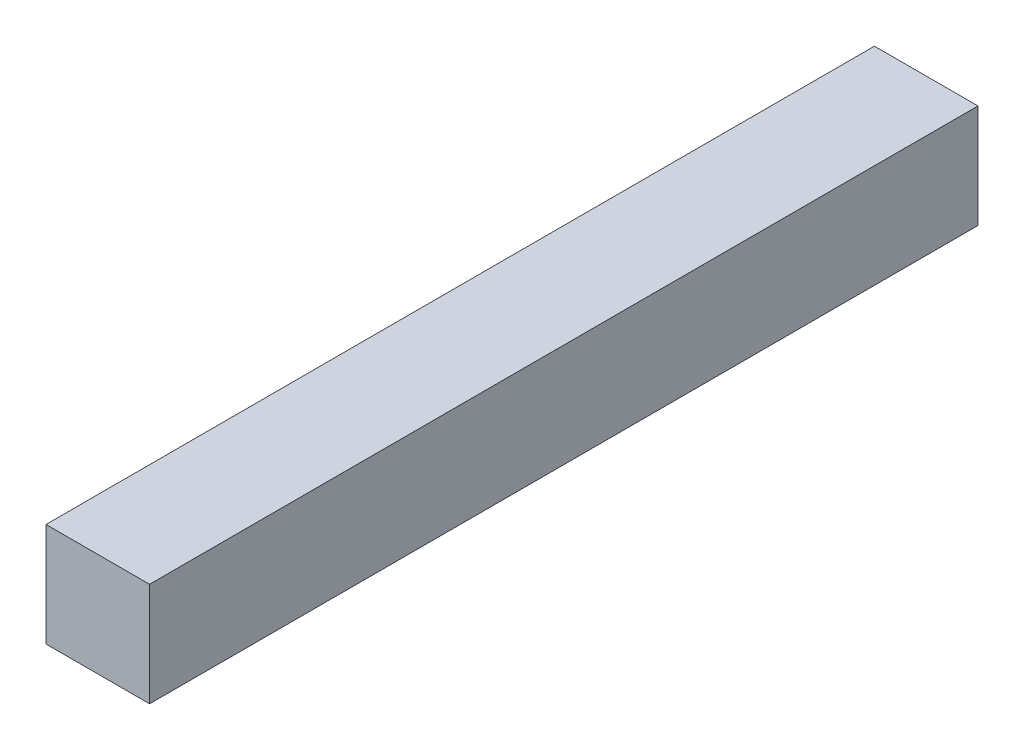
ISO-10303-21;
HEADER;
FILE_DESCRIPTION(('STEP AP214'),'2;1');
FILE_NAME('part.step','',(''),(''),'','','');
FILE_SCHEMA(('AUTOMOTIVE_DESIGN { 1 0 10303 214 1 1 1 1 }'));
ENDSEC;
DATA;
#1=APPLICATION_CONTEXT('core data for automotive mechanical design processes');
#2=APPLICATION_PROTOCOL_DEFINITION('international standard','automotive_design',2000,#1);
#3=PRODUCT_CONTEXT('',#1,'mechanical');
#4=PRODUCT('Part','Part','',(#3));
#5=PRODUCT_RELATED_PRODUCT_CATEGORY('part','',(#4));
#6=PRODUCT_DEFINITION_FORMATION('','',#4);
#7=PRODUCT_DEFINITION_CONTEXT('part definition',#1,'design');
#8=PRODUCT_DEFINITION('design','',#6,#7);
#9=PRODUCT_DEFINITION_SHAPE('','',#8);
#10=(LENGTH_UNIT() NAMED_UNIT(*) SI_UNIT(.MILLI.,.METRE.));
#11=(NAMED_UNIT(*) PLANE_ANGLE_UNIT() SI_UNIT($,.RADIAN.));
#12=(NAMED_UNIT(*) SI_UNIT($,.STERADIAN.) SOLID_ANGLE_UNIT());
#13=UNCERTAINTY_MEASURE_WITH_UNIT(LENGTH_MEASURE(1.E-05),#10,'distance_accuracy_value','');
#14=(GEOMETRIC_REPRESENTATION_CONTEXT(3) GLOBAL_UNCERTAINTY_ASSIGNED_CONTEXT((#13)) GLOBAL_UNIT_ASSIGNED_CONTEXT((#10,
#11,#12)) REPRESENTATION_CONTEXT('',''));
#15=CARTESIAN_POINT('',(0.,0.,0.));
#16=DIRECTION('',(0.,0.,1.));
#17=DIRECTION('',(1.,0.,0.));
#18=AXIS2_PLACEMENT_3D('',#15,#16,#17);
#19=CARTESIAN_POINT('',(0.,0.,203.2));
#20=DIRECTION('',(1.,0.,0.));
#21=DIRECTION('',(0.,0.,-1.));
#22=AXIS2_PLACEMENT_3D('',#19,#20,#21);
#23=PLANE('',#22);
#24=DIRECTION('',(0.,-1.,0.));
#25=VECTOR('',#24,1.);
#26=CARTESIAN_POINT('',(0.,0.,0.));
#27=LINE('',#26,#25);
#28=CARTESIAN_POINT('',(0.,25.4,0.));
#29=VERTEX_POINT('',#28);
#30=CARTESIAN_POINT('',(0.,0.,0.));
#31=VERTEX_POINT('',#30);
#32=EDGE_CURVE('E98',#29,#31,#27,.T.);
#33=ORIENTED_EDGE('',*,*,#32,.T.);
#34=DIRECTION('',(0.,0.,-1.));
#35=VECTOR('',#34,1.);
#36=CARTESIAN_POINT('',(0.,0.,203.2));
#37=LINE('',#36,#35);
#38=CARTESIAN_POINT('',(0.,0.,203.2));
#39=VERTEX_POINT('',#38);
#40=EDGE_CURVE('E11',#39,#31,#37,.T.);
#41=ORIENTED_EDGE('',*,*,#40,.F.);
#42=DIRECTION('',(0.,-1.,0.));
#43=VECTOR('',#42,1.);
#44=CARTESIAN_POINT('',(0.,0.,203.2));
#45=LINE('',#44,#43);
#46=CARTESIAN_POINT('',(0.,25.4,203.2));
#47=VERTEX_POINT('',#46);
#48=EDGE_CURVE('E86',#47,#39,#45,.T.);
#49=ORIENTED_EDGE('',*,*,#48,.F.);
#50=DIRECTION('',(0.,0.,-1.));
#51=VECTOR('',#50,1.);
#52=CARTESIAN_POINT('',(0.,25.4,203.2));
#53=LINE('',#52,#51);
#54=EDGE_CURVE('E94',#47,#29,#53,.T.);
#55=ORIENTED_EDGE('',*,*,#54,.T.);
#56=EDGE_LOOP('',(#33,#41,#49,#55));
#57=FACE_BOUND('',#56,.T.);
#58=ADVANCED_FACE('F35',(#57),#23,.F.);
#59=CARTESIAN_POINT('',(0.,0.,203.2));
#60=DIRECTION('',(0.,1.,0.));
#61=DIRECTION('',(0.,0.,1.));
#62=AXIS2_PLACEMENT_3D('',#59,#60,#61);
#63=PLANE('',#62);
#64=DIRECTION('',(1.,0.,0.));
#65=VECTOR('',#64,1.);
#66=CARTESIAN_POINT('',(0.,0.,0.));
#67=LINE('',#66,#65);
#68=CARTESIAN_POINT('',(25.4,0.,0.));
#69=VERTEX_POINT('',#68);
#70=EDGE_CURVE('E90',#31,#69,#67,.T.);
#71=ORIENTED_EDGE('',*,*,#70,.T.);
#72=DIRECTION('',(0.,0.,-1.));
#73=VECTOR('',#72,1.);
#74=CARTESIAN_POINT('',(25.4,0.,203.2));
#75=LINE('',#74,#73);
#76=CARTESIAN_POINT('',(25.4,0.,203.2));
#77=VERTEX_POINT('',#76);
#78=EDGE_CURVE('E43',#77,#69,#75,.T.);
#79=ORIENTED_EDGE('',*,*,#78,.F.);
#80=DIRECTION('',(1.,0.,0.));
#81=VECTOR('',#80,1.);
#82=CARTESIAN_POINT('',(0.,0.,203.2));
#83=LINE('',#82,#81);
#84=EDGE_CURVE('E81',#39,#77,#83,.T.);
#85=ORIENTED_EDGE('',*,*,#84,.F.);
#86=ORIENTED_EDGE('',*,*,#40,.T.);
#87=EDGE_LOOP('',(#71,#79,#85,#86));
#88=FACE_BOUND('',#87,.T.);
#89=ADVANCED_FACE('F89',(#88),#63,.F.);
#90=CARTESIAN_POINT('',(25.4,0.,203.2));
#91=DIRECTION('',(-1.,0.,0.));
#92=DIRECTION('',(0.,0.,1.));
#93=AXIS2_PLACEMENT_3D('',#90,#91,#92);
#94=PLANE('',#93);
#95=DIRECTION('',(0.,1.,0.));
#96=VECTOR('',#95,1.);
#97=CARTESIAN_POINT('',(25.4,0.,0.));
#98=LINE('',#97,#96);
#99=CARTESIAN_POINT('',(25.4,25.4,0.));
#100=VERTEX_POINT('',#99);
#101=EDGE_CURVE('E68',#69,#100,#98,.T.);
#102=ORIENTED_EDGE('',*,*,#101,.T.);
#103=DIRECTION('',(0.,0.,-1.));
#104=VECTOR('',#103,1.);
#105=CARTESIAN_POINT('',(25.4,25.4,203.2));
#106=LINE('',#105,#104);
#107=CARTESIAN_POINT('',(25.4,25.4,203.2));
#108=VERTEX_POINT('',#107);
#109=EDGE_CURVE('E91',#108,#100,#106,.T.);
#110=ORIENTED_EDGE('',*,*,#109,.F.);
#111=DIRECTION('',(0.,1.,0.));
#112=VECTOR('',#111,1.);
#113=CARTESIAN_POINT('',(25.4,0.,203.2));
#114=LINE('',#113,#112);
#115=EDGE_CURVE('E84',#77,#108,#114,.T.);
#116=ORIENTED_EDGE('',*,*,#115,.F.);
#117=ORIENTED_EDGE('',*,*,#78,.T.);
#118=EDGE_LOOP('',(#102,#110,#116,#117));
#119=FACE_BOUND('',#118,.T.);
#120=ADVANCED_FACE('F92',(#119),#94,.F.);
#121=CARTESIAN_POINT('',(0.,25.4,203.2));
#122=DIRECTION('',(0.,-1.,0.));
#123=DIRECTION('',(0.,0.,-1.));
#124=AXIS2_PLACEMENT_3D('',#121,#122,#123);
#125=PLANE('',#124);
#126=DIRECTION('',(-1.,0.,0.));
#127=VECTOR('',#126,1.);
#128=CARTESIAN_POINT('',(0.,25.4,0.));
#129=LINE('',#128,#127);
#130=EDGE_CURVE('E74',#100,#29,#129,.T.);
#131=ORIENTED_EDGE('',*,*,#130,.T.);
#132=ORIENTED_EDGE('',*,*,#54,.F.);
#133=DIRECTION('',(-1.,0.,0.));
#134=VECTOR('',#133,1.);
#135=CARTESIAN_POINT('',(0.,25.4,203.2));
#136=LINE('',#135,#134);
#137=EDGE_CURVE('E51',#108,#47,#136,.T.);
#138=ORIENTED_EDGE('',*,*,#137,.F.);
#139=ORIENTED_EDGE('',*,*,#109,.T.);
#140=EDGE_LOOP('',(#131,#132,#138,#139));
#141=FACE_BOUND('',#140,.T.);
#142=ADVANCED_FACE('F105',(#141),#125,.F.);
#143=CARTESIAN_POINT('',(0.,0.,203.2));
#144=DIRECTION('',(0.,0.,-1.));
#145=DIRECTION('',(-1.,0.,0.));
#146=AXIS2_PLACEMENT_3D('',#143,#144,#145);
#147=PLANE('',#146);
#148=ORIENTED_EDGE('',*,*,#48,.T.);
#149=ORIENTED_EDGE('',*,*,#84,.T.);
#150=ORIENTED_EDGE('',*,*,#115,.T.);
#151=ORIENTED_EDGE('',*,*,#137,.T.);
#152=EDGE_LOOP('',(#148,#149,#150,#151));
#153=FACE_BOUND('',#152,.T.);
#154=ADVANCED_FACE('F82',(#153),#147,.F.);
#155=CARTESIAN_POINT('',(0.,0.,0.));
#156=DIRECTION('',(0.,0.,-1.));
#157=DIRECTION('',(-1.,0.,0.));
#158=AXIS2_PLACEMENT_3D('',#155,#156,#157);
#159=PLANE('',#158);
#160=ORIENTED_EDGE('',*,*,#32,.F.);
#161=ORIENTED_EDGE('',*,*,#130,.F.);
#162=ORIENTED_EDGE('',*,*,#101,.F.);
#163=ORIENTED_EDGE('',*,*,#70,.F.);
#164=EDGE_LOOP('',(#160,#161,#162,#163));
#165=FACE_BOUND('',#164,.T.);
#166=ADVANCED_FACE('F108',(#165),#159,.T.);
#167=CLOSED_SHELL('',(#58,#89,#120,#142,#154,#166));
#168=MANIFOLD_SOLID_BREP('B2',#167);
#169=ADVANCED_BREP_SHAPE_REPRESENTATION('',(#18,#168),#14);
#170=SHAPE_DEFINITION_REPRESENTATION(#9,#169);
ENDSEC;
END-ISO-10303-21;
